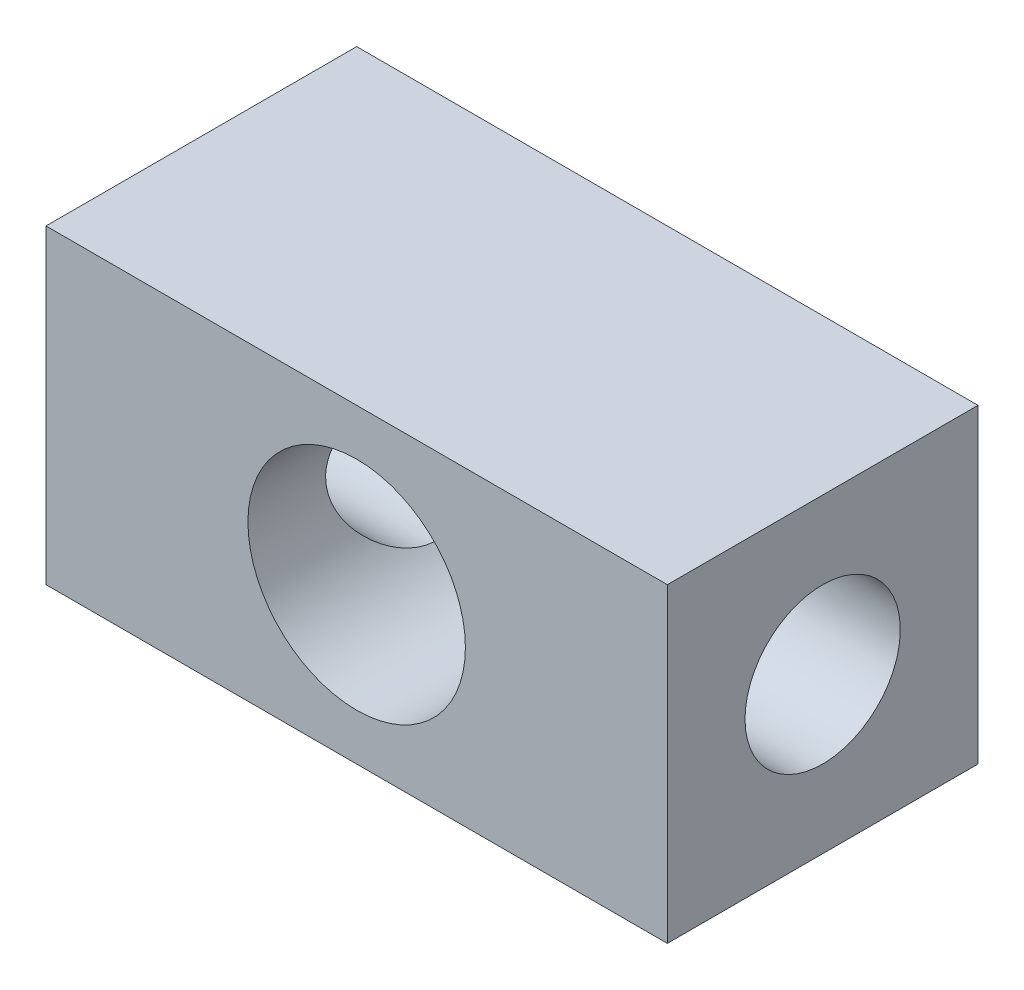
ISO-10303-21;
HEADER;
FILE_DESCRIPTION(('STEP AP214'),'2;1');
FILE_NAME('part.step','',(''),(''),'','','');
FILE_SCHEMA(('AUTOMOTIVE_DESIGN { 1 0 10303 214 1 1 1 1 }'));
ENDSEC;
DATA;
#1=APPLICATION_CONTEXT('core data for automotive mechanical design processes');
#2=APPLICATION_PROTOCOL_DEFINITION('international standard','automotive_design',2000,#1);
#3=PRODUCT_CONTEXT('',#1,'mechanical');
#4=PRODUCT('Part','Part','',(#3));
#5=PRODUCT_RELATED_PRODUCT_CATEGORY('part','',(#4));
#6=PRODUCT_DEFINITION_FORMATION('','',#4);
#7=PRODUCT_DEFINITION_CONTEXT('part definition',#1,'design');
#8=PRODUCT_DEFINITION('design','',#6,#7);
#9=PRODUCT_DEFINITION_SHAPE('','',#8);
#10=(LENGTH_UNIT() NAMED_UNIT(*) SI_UNIT(.MILLI.,.METRE.));
#11=(NAMED_UNIT(*) PLANE_ANGLE_UNIT() SI_UNIT($,.RADIAN.));
#12=(NAMED_UNIT(*) SI_UNIT($,.STERADIAN.) SOLID_ANGLE_UNIT());
#13=UNCERTAINTY_MEASURE_WITH_UNIT(LENGTH_MEASURE(1.E-05),#10,'distance_accuracy_value','');
#14=(GEOMETRIC_REPRESENTATION_CONTEXT(3) GLOBAL_UNCERTAINTY_ASSIGNED_CONTEXT((#13)) GLOBAL_UNIT_ASSIGNED_CONTEXT((#10,
#11,#12)) REPRESENTATION_CONTEXT('',''));
#15=CARTESIAN_POINT('',(0.,0.,0.));
#16=DIRECTION('',(0.,0.,1.));
#17=DIRECTION('',(1.,0.,0.));
#18=AXIS2_PLACEMENT_3D('',#15,#16,#17);
#19=CARTESIAN_POINT('',(0.,0.,19.9999999999998));
#20=DIRECTION('',(0.,0.,-0.999999999999984));
#21=DIRECTION('',(-0.999999999999992,0.,0.));
#22=AXIS2_PLACEMENT_3D('',#19,#20,#21);
#23=PLANE('',#22);
#24=DIRECTION('',(0.,0.999999999999992,0.));
#25=VECTOR('',#24,1.);
#26=CARTESIAN_POINT('',(19.9999999999995,-9.99999999999999,19.9999999999998));
#27=LINE('',#26,#25);
#28=CARTESIAN_POINT('',(19.9999999999995,-9.99999999999999,19.9999999999998));
#29=VERTEX_POINT('',#28);
#30=CARTESIAN_POINT('',(20.,9.99999999999951,19.9999999999998));
#31=VERTEX_POINT('',#30);
#32=EDGE_CURVE('E98',#29,#31,#27,.T.);
#33=ORIENTED_EDGE('',*,*,#32,.T.);
#34=DIRECTION('',(-0.999999999999992,0.,0.));
#35=VECTOR('',#34,1.);
#36=CARTESIAN_POINT('',(-20.,10.,19.9999999999998));
#37=LINE('',#36,#35);
#38=CARTESIAN_POINT('',(-20.,10.,19.9999999999998));
#39=VERTEX_POINT('',#38);
#40=EDGE_CURVE('E93',#31,#39,#37,.T.);
#41=ORIENTED_EDGE('',*,*,#40,.T.);
#42=DIRECTION('',(0.,-0.999999999999992,0.));
#43=VECTOR('',#42,1.);
#44=CARTESIAN_POINT('',(-20.0000000000005,-9.99999999999952,19.9999999999998));
#45=LINE('',#44,#43);
#46=CARTESIAN_POINT('',(-20.0000000000005,-9.99999999999952,19.9999999999998));
#47=VERTEX_POINT('',#46);
#48=EDGE_CURVE('E96',#39,#47,#45,.T.);
#49=ORIENTED_EDGE('',*,*,#48,.T.);
#50=DIRECTION('',(0.999999999999992,0.,0.));
#51=VECTOR('',#50,1.);
#52=CARTESIAN_POINT('',(-20.0000000000005,-9.99999999999952,19.9999999999998));
#53=LINE('',#52,#51);
#54=EDGE_CURVE('E63',#47,#29,#53,.T.);
#55=ORIENTED_EDGE('',*,*,#54,.T.);
#56=EDGE_LOOP('',(#33,#41,#49,#55));
#57=FACE_BOUND('',#56,.T.);
#58=CARTESIAN_POINT('',(0.,0.,19.9999999999998));
#59=DIRECTION('',(0.,0.,0.999999999999984));
#60=DIRECTION('',(0.999999999999992,0.,0.));
#61=AXIS2_PLACEMENT_3D('',#58,#59,#60);
#62=CIRCLE('',#61,7.);
#63=CARTESIAN_POINT('',(6.99999999999994,0.,19.9999999999998));
#64=VERTEX_POINT('',#63);
#65=EDGE_CURVE('E120',#64,#64,#62,.T.);
#66=ORIENTED_EDGE('',*,*,#65,.F.);
#67=EDGE_LOOP('',(#66));
#68=FACE_BOUND('',#67,.T.);
#69=ADVANCED_FACE('F38',(#57,#68),#23,.F.);
#70=CARTESIAN_POINT('',(0.,0.,0.));
#71=DIRECTION('',(0.,0.,-0.999999999999984));
#72=DIRECTION('',(-0.999999999999992,0.,0.));
#73=AXIS2_PLACEMENT_3D('',#70,#71,#72);
#74=PLANE('',#73);
#75=DIRECTION('',(0.,0.999999999999992,0.));
#76=VECTOR('',#75,1.);
#77=CARTESIAN_POINT('',(19.9999999999995,-9.99999999999999,0.));
#78=LINE('',#77,#76);
#79=CARTESIAN_POINT('',(19.9999999999995,-9.99999999999999,0.));
#80=VERTEX_POINT('',#79);
#81=CARTESIAN_POINT('',(20.,9.99999999999951,0.));
#82=VERTEX_POINT('',#81);
#83=EDGE_CURVE('E116',#80,#82,#78,.T.);
#84=ORIENTED_EDGE('',*,*,#83,.F.);
#85=DIRECTION('',(0.999999999999992,0.,0.));
#86=VECTOR('',#85,1.);
#87=CARTESIAN_POINT('',(-20.0000000000005,-9.99999999999952,0.));
#88=LINE('',#87,#86);
#89=CARTESIAN_POINT('',(-20.0000000000005,-9.99999999999952,0.));
#90=VERTEX_POINT('',#89);
#91=EDGE_CURVE('E86',#90,#80,#88,.T.);
#92=ORIENTED_EDGE('',*,*,#91,.F.);
#93=DIRECTION('',(0.,-0.999999999999992,0.));
#94=VECTOR('',#93,1.);
#95=CARTESIAN_POINT('',(-20.0000000000005,-9.99999999999952,0.));
#96=LINE('',#95,#94);
#97=CARTESIAN_POINT('',(-20.,10.,0.));
#98=VERTEX_POINT('',#97);
#99=EDGE_CURVE('E80',#98,#90,#96,.T.);
#100=ORIENTED_EDGE('',*,*,#99,.F.);
#101=DIRECTION('',(-0.999999999999992,0.,0.));
#102=VECTOR('',#101,1.);
#103=CARTESIAN_POINT('',(-20.,10.,0.));
#104=LINE('',#103,#102);
#105=EDGE_CURVE('E103',#82,#98,#104,.T.);
#106=ORIENTED_EDGE('',*,*,#105,.F.);
#107=EDGE_LOOP('',(#84,#92,#100,#106));
#108=FACE_BOUND('',#107,.T.);
#109=CARTESIAN_POINT('',(0.,0.,0.));
#110=DIRECTION('',(0.,0.,0.999999999999984));
#111=DIRECTION('',(0.999999999999992,0.,0.));
#112=AXIS2_PLACEMENT_3D('',#109,#110,#111);
#113=CIRCLE('',#112,7.);
#114=CARTESIAN_POINT('',(6.99999999999994,0.,0.));
#115=VERTEX_POINT('',#114);
#116=EDGE_CURVE('E180',#115,#115,#113,.T.);
#117=ORIENTED_EDGE('',*,*,#116,.T.);
#118=EDGE_LOOP('',(#117));
#119=FACE_BOUND('',#118,.T.);
#120=ADVANCED_FACE('F155',(#108,#119),#74,.T.);
#121=CARTESIAN_POINT('',(19.9999999999995,-9.99999999999999,19.9999999999998));
#122=DIRECTION('',(-0.999999999999992,0.,0.));
#123=DIRECTION('',(0.,0.,0.999999999999984));
#124=AXIS2_PLACEMENT_3D('',#121,#122,#123);
#125=PLANE('',#124);
#126=CARTESIAN_POINT('',(20.,-4.92661467177413E-13,9.99999999999988));
#127=DIRECTION('',(-0.999999999999992,0.,0.));
#128=DIRECTION('',(0.,0.,0.999999999999984));
#129=AXIS2_PLACEMENT_3D('',#126,#127,#128);
#130=CIRCLE('',#129,5.);
#131=CARTESIAN_POINT('',(20.,-4.92661467177413E-13,14.9999999999998));
#132=VERTEX_POINT('',#131);
#133=EDGE_CURVE('E136',#132,#132,#130,.T.);
#134=ORIENTED_EDGE('',*,*,#133,.T.);
#135=EDGE_LOOP('',(#134));
#136=FACE_BOUND('',#135,.T.);
#137=ORIENTED_EDGE('',*,*,#83,.T.);
#138=DIRECTION('',(0.,0.,-0.999999999999984));
#139=VECTOR('',#138,1.);
#140=CARTESIAN_POINT('',(20.,9.99999999999951,19.9999999999998));
#141=LINE('',#140,#139);
#142=EDGE_CURVE('E11',#31,#82,#141,.T.);
#143=ORIENTED_EDGE('',*,*,#142,.F.);
#144=ORIENTED_EDGE('',*,*,#32,.F.);
#145=DIRECTION('',(0.,0.,-0.999999999999984));
#146=VECTOR('',#145,1.);
#147=CARTESIAN_POINT('',(19.9999999999995,-9.99999999999999,19.9999999999998));
#148=LINE('',#147,#146);
#149=EDGE_CURVE('E112',#29,#80,#148,.T.);
#150=ORIENTED_EDGE('',*,*,#149,.T.);
#151=EDGE_LOOP('',(#137,#143,#144,#150));
#152=FACE_BOUND('',#151,.T.);
#153=ADVANCED_FACE('F40',(#136,#152),#125,.F.);
#154=CARTESIAN_POINT('',(-20.,10.,19.9999999999998));
#155=DIRECTION('',(0.,-0.999999999999992,0.));
#156=DIRECTION('',(0.,0.,-0.999999999999984));
#157=AXIS2_PLACEMENT_3D('',#154,#155,#156);
#158=PLANE('',#157);
#159=ORIENTED_EDGE('',*,*,#105,.T.);
#160=DIRECTION('',(0.,0.,-0.999999999999984));
#161=VECTOR('',#160,1.);
#162=CARTESIAN_POINT('',(-20.,10.,19.9999999999998));
#163=LINE('',#162,#161);
#164=EDGE_CURVE('E54',#39,#98,#163,.T.);
#165=ORIENTED_EDGE('',*,*,#164,.F.);
#166=ORIENTED_EDGE('',*,*,#40,.F.);
#167=ORIENTED_EDGE('',*,*,#142,.T.);
#168=EDGE_LOOP('',(#159,#165,#166,#167));
#169=FACE_BOUND('',#168,.T.);
#170=ADVANCED_FACE('F102',(#169),#158,.F.);
#171=CARTESIAN_POINT('',(-20.0000000000005,-9.99999999999952,19.9999999999998));
#172=DIRECTION('',(0.999999999999992,0.,0.));
#173=DIRECTION('',(0.,0.,-0.999999999999984));
#174=AXIS2_PLACEMENT_3D('',#171,#172,#173);
#175=PLANE('',#174);
#176=CARTESIAN_POINT('',(-20.,0.,9.99999999999988));
#177=DIRECTION('',(-0.999999999999992,0.,0.));
#178=DIRECTION('',(0.,0.,0.999999999999984));
#179=AXIS2_PLACEMENT_3D('',#176,#177,#178);
#180=CIRCLE('',#179,5.);
#181=CARTESIAN_POINT('',(-20.,0.,14.9999999999998));
#182=VERTEX_POINT('',#181);
#183=EDGE_CURVE('E199',#182,#182,#180,.T.);
#184=ORIENTED_EDGE('',*,*,#183,.F.);
#185=EDGE_LOOP('',(#184));
#186=FACE_BOUND('',#185,.T.);
#187=ORIENTED_EDGE('',*,*,#99,.T.);
#188=DIRECTION('',(0.,0.,-0.999999999999984));
#189=VECTOR('',#188,1.);
#190=CARTESIAN_POINT('',(-20.0000000000005,-9.99999999999952,19.9999999999998));
#191=LINE('',#190,#189);
#192=EDGE_CURVE('E105',#47,#90,#191,.T.);
#193=ORIENTED_EDGE('',*,*,#192,.F.);
#194=ORIENTED_EDGE('',*,*,#48,.F.);
#195=ORIENTED_EDGE('',*,*,#164,.T.);
#196=EDGE_LOOP('',(#187,#193,#194,#195));
#197=FACE_BOUND('',#196,.T.);
#198=ADVANCED_FACE('F107',(#186,#197),#175,.F.);
#199=CARTESIAN_POINT('',(-20.0000000000005,-9.99999999999952,19.9999999999998));
#200=DIRECTION('',(0.,0.999999999999992,0.));
#201=DIRECTION('',(0.,0.,0.999999999999984));
#202=AXIS2_PLACEMENT_3D('',#199,#200,#201);
#203=PLANE('',#202);
#204=ORIENTED_EDGE('',*,*,#91,.T.);
#205=ORIENTED_EDGE('',*,*,#149,.F.);
#206=ORIENTED_EDGE('',*,*,#54,.F.);
#207=ORIENTED_EDGE('',*,*,#192,.T.);
#208=EDGE_LOOP('',(#204,#205,#206,#207));
#209=FACE_BOUND('',#208,.T.);
#210=ADVANCED_FACE('F151',(#209),#203,.F.);
#211=CARTESIAN_POINT('',(0.,0.,19.9999999999998));
#212=DIRECTION('',(0.,0.,-0.999999999999984));
#213=DIRECTION('',(-0.999999999999992,0.,0.));
#214=AXIS2_PLACEMENT_3D('',#211,#212,#213);
#215=CYLINDRICAL_SURFACE('',#214,7.);
#216=CARTESIAN_POINT('',(-7.00000000000001,0.,14.9999999999997));
#217=CARTESIAN_POINT('',(-7.00000020838973,-0.123706830347805,15.0000002235467));
#218=CARTESIAN_POINT('',(-6.9967139987286,-0.247410973485887,14.9954026823639));
#219=CARTESIAN_POINT('',(-6.98364877001322,-0.493842597599144,14.9770866330283));
#220=CARTESIAN_POINT('',(-6.97386724806996,-0.616569683621388,14.9633646088648));
#221=CARTESIAN_POINT('',(-6.94804684346392,-0.8600169345434,14.9270192039855));
#222=CARTESIAN_POINT('',(-6.93200830974386,-0.980737210968106,14.9043963196546));
#223=CARTESIAN_POINT('',(-6.89403980063153,-1.2193522544136,14.8505822220874));
#224=CARTESIAN_POINT('',(-6.87210728454189,-1.33724577898899,14.8193873136092));
#225=CARTESIAN_POINT('',(-6.8229681756075,-1.56876671294683,14.7490551859887));
#226=CARTESIAN_POINT('',(-6.79579130680711,-1.68241404829331,14.7099626730663));
#227=CARTESIAN_POINT('',(-6.73663568699667,-1.90554075562307,14.6241993320913));
#228=CARTESIAN_POINT('',(-6.70465504948949,-2.01501846887817,14.5775255261861));
#229=CARTESIAN_POINT('',(-6.60241573373066,-2.3363458262759,14.426891765315));
#230=CARTESIAN_POINT('',(-6.52581508656124,-2.54129209226529,14.3122568985109));
#231=CARTESIAN_POINT('',(-6.35349136110252,-2.94722710575681,14.046966332333));
#232=CARTESIAN_POINT('',(-6.25666965742072,-3.14621427453574,13.8940028483968));
#233=CARTESIAN_POINT('',(-6.05567589289293,-3.51757946240297,13.5621257159282));
#234=CARTESIAN_POINT('',(-5.95149294556465,-3.68991681632723,13.3831732017844));
#235=CARTESIAN_POINT('',(-5.78580169781964,-3.94171508067847,13.0796743465278));
#236=CARTESIAN_POINT('',(-5.72420876579598,-4.03039974891799,12.9626846223724));
#237=CARTESIAN_POINT('',(-5.60277478998987,-4.19756740724413,12.7206732301415));
#238=CARTESIAN_POINT('',(-5.54293422728701,-4.27604761586084,12.595649385992));
#239=CARTESIAN_POINT('',(-5.42706064686451,-4.42218280560598,12.3379889887195));
#240=CARTESIAN_POINT('',(-5.37102235890195,-4.4898529542356,12.2053634631193));
#241=CARTESIAN_POINT('',(-5.26491676198806,-4.61381658166172,11.9326555040714));
#242=CARTESIAN_POINT('',(-5.21484853251542,-4.67011181528468,11.792574225054));
#243=CARTESIAN_POINT('',(-5.10685206277557,-4.7883819882448,11.453927188912));
#244=CARTESIAN_POINT('',(-5.05248282898125,-4.84522975768879,11.2523117138446));
#245=CARTESIAN_POINT('',(-4.98781463924016,-4.91148095084015,10.9426138259305));
#246=CARTESIAN_POINT('',(-4.96907802082134,-4.93038988462367,10.8382228939427));
#247=CARTESIAN_POINT('',(-4.93791198912532,-4.96160430011165,10.6275366581224));
#248=CARTESIAN_POINT('',(-4.92548008185897,-4.97391239305785,10.5212421245622));
#249=CARTESIAN_POINT('',(-4.90740411338569,-4.99174806834481,10.3067748634485));
#250=CARTESIAN_POINT('',(-4.90180679564454,-4.99722896284063,10.1985942785351));
#251=CARTESIAN_POINT('',(-4.89781588192487,-5.00114067376618,9.98197318784434));
#252=CARTESIAN_POINT('',(-4.89942206309582,-4.99957170829339,9.87353269021138));
#253=CARTESIAN_POINT('',(-4.90976470584961,-4.98941497357778,9.65727111060063));
#254=CARTESIAN_POINT('',(-4.91850485918716,-4.98082357029485,9.54945037844392));
#255=CARTESIAN_POINT('',(-4.94272114520704,-4.95679292982502,9.33530153044341));
#256=CARTESIAN_POINT('',(-4.95820063893986,-4.94135027570232,9.22897418673198));
#257=CARTESIAN_POINT('',(-4.99760451378599,-4.90151284488863,9.00517491853056));
#258=CARTESIAN_POINT('',(-5.02235272142069,-4.87622911468873,8.88800608955653));
#259=CARTESIAN_POINT('',(-5.07843189223425,-4.81779740683501,8.65723326425947));
#260=CARTESIAN_POINT('',(-5.10976728413051,-4.78464413635913,8.54363172566975));
#261=CARTESIAN_POINT('',(-5.21188277843332,-4.67400343048202,8.20862755517835));
#262=CARTESIAN_POINT('',(-5.29073017996704,-4.58537486342014,7.99324123016086));
#263=CARTESIAN_POINT('',(-5.43117977056445,-4.41699659938636,7.65204599043592));
#264=CARTESIAN_POINT('',(-5.48936415421434,-4.34470821312967,7.52094158802316));
#265=CARTESIAN_POINT('',(-5.60880434984635,-4.18937966154071,7.26663631329907));
#266=CARTESIAN_POINT('',(-5.67006102833891,-4.10633645234885,7.1434376933229));
#267=CARTESIAN_POINT('',(-5.79375242217182,-3.92989283704836,6.90517433077248));
#268=CARTESIAN_POINT('',(-5.85618806526465,-3.83648396587965,6.79011636365125));
#269=CARTESIAN_POINT('',(-5.98049354239976,-3.63967604580767,6.56857115451686));
#270=CARTESIAN_POINT('',(-6.04236343357915,-3.53627801821646,6.46208303834074));
#271=CARTESIAN_POINT('',(-6.16459711373886,-3.31865566402191,6.25712810012962));
#272=CARTESIAN_POINT('',(-6.22493938999137,-3.20433257194003,6.1587531181748));
#273=CARTESIAN_POINT('',(-6.34192222059391,-2.96607983417485,5.97193873301371));
#274=CARTESIAN_POINT('',(-6.39856329043482,-2.84215153154974,5.88349794496925));
#275=CARTESIAN_POINT('',(-6.50656183204893,-2.58534749281645,5.71755840499967));
#276=CARTESIAN_POINT('',(-6.5579287142744,-2.45248841807648,5.6400400693329));
#277=CARTESIAN_POINT('',(-6.65402794776653,-2.1782999787836,5.4967890060317));
#278=CARTESIAN_POINT('',(-6.69876279357062,-2.03697382721868,5.43105184513832));
#279=CARTESIAN_POINT('',(-6.76979900167759,-1.78393161589398,5.32761267432847));
#280=CARTESIAN_POINT('',(-6.79788920127105,-1.67388190691359,5.28703979494306));
#281=CARTESIAN_POINT('',(-6.84910120159545,-1.45016241863139,5.21346826836561));
#282=CARTESIAN_POINT('',(-6.87222406946423,-1.33649342290235,5.18046799423759));
#283=CARTESIAN_POINT('',(-6.91302945246583,-1.10620699746518,5.12245952686409));
#284=CARTESIAN_POINT('',(-6.93071352231445,-0.989590420676784,5.09744904960391));
#285=CARTESIAN_POINT('',(-6.96026202465164,-0.754198086697397,5.05576458904342));
#286=CARTESIAN_POINT('',(-6.9721290724302,-0.635423324765784,5.03908685933646));
#287=CARTESIAN_POINT('',(-6.9898180326742,-0.396096531940557,5.01425707098359));
#288=CARTESIAN_POINT('',(-6.99561783247229,-0.275539612785588,5.00613619784966));
#289=CARTESIAN_POINT('',(-7.00095849009119,-0.0340589156115996,4.99865751346771));
#290=CARTESIAN_POINT('',(-7.00050163923066,0.0868647118914972,4.99929649417484));
#291=CARTESIAN_POINT('',(-6.99334434902713,0.32819487387,5.0093209417246));
#292=CARTESIAN_POINT('',(-6.98664219024222,0.448601256767236,5.01870881729023));
#293=CARTESIAN_POINT('',(-6.96714954851426,0.687926838509074,5.04608590608886));
#294=CARTESIAN_POINT('',(-6.95435917772169,0.806846064707066,5.06407496088021));
#295=CARTESIAN_POINT('',(-6.92373169105252,1.03669034077475,5.10732357714417));
#296=CARTESIAN_POINT('',(-6.90616594722286,1.14772530670985,5.13219319610467));
#297=CARTESIAN_POINT('',(-6.86612520630985,1.36703042618002,5.1891703495779));
#298=CARTESIAN_POINT('',(-6.84364861236168,1.47529966756191,5.22128023852367));
#299=CARTESIAN_POINT('',(-6.76946421834352,1.79502091246225,5.32792482053032));
#300=CARTESIAN_POINT('',(-6.71097815818561,2.0015570607615,5.4128072090868));
#301=CARTESIAN_POINT('',(-6.57387491863988,2.4158013396306,5.61571771440943));
#302=CARTESIAN_POINT('',(-6.49391167742692,2.62191172181234,5.73605629620726));
#303=CARTESIAN_POINT('',(-6.32248637138395,3.01190946129224,6.00197911016946));
#304=CARTESIAN_POINT('',(-6.23101540686784,3.19577940035423,6.14758291502083));
#305=CARTESIAN_POINT('',(-6.02506352997625,3.57103500131529,6.48953581447124));
#306=CARTESIAN_POINT('',(-5.90941444692481,3.75775754044467,6.69029969005171));
#307=CARTESIAN_POINT('',(-5.67976360472236,4.09660125204293,7.12026996408595));
#308=CARTESIAN_POINT('',(-5.56576275441118,4.24870396900502,7.34949143286825));
#309=CARTESIAN_POINT('',(-5.36830225813517,4.4946887035956,7.797165849694));
#310=CARTESIAN_POINT('',(-5.28284827698364,4.59394222437912,8.01177234065841));
#311=CARTESIAN_POINT('',(-5.13141345636209,4.76250754552193,8.4588015461608));
#312=CARTESIAN_POINT('',(-5.06539151754954,4.83188268572662,8.69118532943065));
#313=CARTESIAN_POINT('',(-4.97281140949577,4.92694108133017,9.12536440967209));
#314=CARTESIAN_POINT('',(-4.94119323485699,4.95835553271124,9.32479519441026));
#315=CARTESIAN_POINT('',(-4.90241792810089,4.99670946606537,9.72827233820071));
#316=CARTESIAN_POINT('',(-4.89523352826003,5.00367623156318,9.93231329610971));
#317=CARTESIAN_POINT('',(-4.90648075072078,4.99264295050727,10.3389850866712));
#318=CARTESIAN_POINT('',(-4.92491410752098,4.97464121341411,10.5416158229084));
#319=CARTESIAN_POINT('',(-4.98443760918039,4.91498710965499,10.9400224787394));
#320=CARTESIAN_POINT('',(-5.02556280172854,4.87329815495575,11.135787295171));
#321=CARTESIAN_POINT('',(-5.14200261452265,4.75069025016368,11.5814422945041));
#322=CARTESIAN_POINT('',(-5.22418017553785,4.66126522644867,11.8271975118351));
#323=CARTESIAN_POINT('',(-5.36059508623788,4.50210411725602,12.1789259463673));
#324=CARTESIAN_POINT('',(-5.40832357564236,4.44479567507552,12.2934790660688));
#325=CARTESIAN_POINT('',(-5.50678597491563,4.32220971449357,12.5168864608464));
#326=CARTESIAN_POINT('',(-5.55751965778054,4.25693279761421,12.6257411651976));
#327=CARTESIAN_POINT('',(-5.71505652733009,4.04590690194077,12.9492592128555));
#328=CARTESIAN_POINT('',(-5.82467625637427,3.88776756391502,13.1547112586291));
#329=CARTESIAN_POINT('',(-5.98735914065872,3.62795510967357,13.443063811555));
#330=CARTESIAN_POINT('',(-6.04132015327551,3.53753675683184,13.5359153498656));
#331=CARTESIAN_POINT('',(-6.14770901514375,3.34923083939272,13.7147695884307));
#332=CARTESIAN_POINT('',(-6.20013658873392,3.25134194311756,13.8007710620019));
#333=CARTESIAN_POINT('',(-6.31122907951895,3.03086404240047,13.9796140827871));
#334=CARTESIAN_POINT('',(-6.36941716980577,2.90692152521491,14.0710904912996));
#335=CARTESIAN_POINT('',(-6.48069645050256,2.64956836988835,14.2430793444256));
#336=CARTESIAN_POINT('',(-6.53378994050184,2.51616205124382,14.3235967426258));
#337=CARTESIAN_POINT('',(-6.63333305417822,2.24060912964317,14.4726028891803));
#338=CARTESIAN_POINT('',(-6.6797893509917,2.09847151388443,14.5411037351812));
#339=CARTESIAN_POINT('',(-6.76463878724721,1.80631427486923,14.665016401042));
#340=CARTESIAN_POINT('',(-6.80303505370807,1.65629773671334,14.7204332980759));
#341=CARTESIAN_POINT('',(-6.86305258081174,1.3833108981588,14.8064765581733));
#342=CARTESIAN_POINT('',(-6.8865060472747,1.26160961479057,14.8398741605641));
#343=CARTESIAN_POINT('',(-6.92714135495755,1.01504263181041,14.8975204885344));
#344=CARTESIAN_POINT('',(-6.94432457497392,0.890177634349862,14.9217712255044));
#345=CARTESIAN_POINT('',(-6.97198481931338,0.638329109483783,14.9607217367808));
#346=CARTESIAN_POINT('',(-6.98246701467066,0.511347293416898,14.9754288758055));
#347=CARTESIAN_POINT('',(-6.99647449097442,0.256242689441575,14.995067883044));
#348=CARTESIAN_POINT('',(-6.99999978417627,0.128119903543484,14.9999997684781));
#349=CARTESIAN_POINT('',(-7.00000000000001,0.,14.9999999999997));
#350=B_SPLINE_CURVE_WITH_KNOTS('',3,(#216,#217,#218,#219,#220,#221,#222,#223,#224,#225,#226,
#227,#228,#229,#230,#231,#232,#233,#234,#235,#236,#237,#238,#239,#240,#241,#242,#243,#244,#245,
#246,#247,#248,#249,#250,#251,#252,#253,#254,#255,#256,#257,#258,#259,#260,#261,#262,#263,#264,
#265,#266,#267,#268,#269,#270,#271,#272,#273,#274,#275,#276,#277,#278,#279,#280,#281,#282,#283,
#284,#285,#286,#287,#288,#289,#290,#291,#292,#293,#294,#295,#296,#297,#298,#299,#300,#301,#302,
#303,#304,#305,#306,#307,#308,#309,#310,#311,#312,#313,#314,#315,#316,#317,#318,#319,#320,#321,
#322,#323,#324,#325,#326,#327,#328,#329,#330,#331,#332,#333,#334,#335,#336,#337,#338,#339,#340,
#341,#342,#343,#344,#345,#346,#347,#348,#349),.UNSPECIFIED.,.T.,.F.,(4,2,2,2,2,2,2,2,2,2,2,2,2,
2,2,2,2,2,2,2,2,2,2,2,2,2,2,2,2,2,2,2,2,2,2,2,2,2,2,2,2,2,2,2,2,2,2,2,2,2,2,2,2,2,2,2,2,2,2,2,2,
2,2,2,2,2,4),(0.,0.370988075311363,0.742119189353167,1.113229609013,1.48450025920449,
1.85372534219346,2.22309580520351,2.96119440683004,3.76545645669395,4.57093387736659,
5.04808282383822,5.52536155725348,6.00196462889938,6.47849411798956,7.12486898649131,
7.44773292534215,7.77046904731926,8.09540029733815,8.42032149521384,8.7454109430361,
9.07066270584188,9.43729317450044,9.80417093025943,10.5385885670463,11.0199765172874,
11.5015010102357,11.9834216722653,12.4652931137684,12.9520296640941,13.4386982783508,
13.924482888458,14.4100843121045,14.771547101344,15.1329321592685,15.4942138166995,
15.8553328952554,16.2177635696501,16.5800615177675,16.9424592422924,17.3048502913748,
17.6498662512394,17.9949945676162,18.6847309611879,19.4371210061719,20.1900965430248,
21.0793568967476,21.9690902023828,22.7207890020046,23.4708863194352,24.0812720855673,
24.6909764464864,25.3007220906016,25.9114121377253,26.7290171085952,27.1388076467794,
27.5485672699124,28.3895670350437,28.8104556334682,29.2314194343297,29.7247401951241,
30.2178372239683,30.7104349429707,31.2028411960805,31.5874461531241,31.9719664863838,
32.3561897343841,32.740412305531),.UNSPECIFIED.);
#351=CARTESIAN_POINT('',(-7.00000000000001,0.,14.9999999999997));
#352=VERTEX_POINT('',#351);
#353=EDGE_CURVE('E42',#352,#352,#350,.T.);
#354=ORIENTED_EDGE('',*,*,#353,.F.);
#355=EDGE_LOOP('',(#354));
#356=FACE_BOUND('',#355,.T.);
#357=CARTESIAN_POINT('',(7.00000000000001,0.,14.9999999999997));
#358=CARTESIAN_POINT('',(7.00000020838973,0.123706830347808,15.0000002235466));
#359=CARTESIAN_POINT('',(6.9967139987286,0.247410973485882,14.9954026823638));
#360=CARTESIAN_POINT('',(6.98364877001322,0.493842597599135,14.9770866330282));
#361=CARTESIAN_POINT('',(6.97386724806996,0.616569683621382,14.9633646088647));
#362=CARTESIAN_POINT('',(6.94804684346392,0.860016934543379,14.9270192039853));
#363=CARTESIAN_POINT('',(6.93200830974386,0.980737210968066,14.9043963196543));
#364=CARTESIAN_POINT('',(6.89403980063153,1.21935225441358,14.8505822220873));
#365=CARTESIAN_POINT('',(6.87210728454188,1.33724577898901,14.8193873136092));
#366=CARTESIAN_POINT('',(6.82296817560751,1.56876671294681,14.7490551859887));
#367=CARTESIAN_POINT('',(6.79579130680713,1.68241404829322,14.7099626730661));
#368=CARTESIAN_POINT('',(6.73663568699672,1.9055407556229,14.6241993320909));
#369=CARTESIAN_POINT('',(6.70465504948955,2.01501846887798,14.5775255261857));
#370=CARTESIAN_POINT('',(6.6024157337307,2.33634582627578,14.4268917653147));
#371=CARTESIAN_POINT('',(6.5258150865612,2.54129209226536,14.312256898511));
#372=CARTESIAN_POINT('',(6.35349136110257,2.94722710575674,14.0469663323329));
#373=CARTESIAN_POINT('',(6.25666965742097,3.1462142745353,13.8940028483962));
#374=CARTESIAN_POINT('',(6.05567589289308,3.51757946240266,13.5621257159277));
#375=CARTESIAN_POINT('',(5.95149294556451,3.68991681632742,13.3831732017846));
#376=CARTESIAN_POINT('',(5.78580169781974,3.94171508067835,13.0796743465277));
#377=CARTESIAN_POINT('',(5.72420876579633,4.03039974891751,12.962684622372));
#378=CARTESIAN_POINT('',(5.60277478999041,4.1975674072434,12.7206732301408));
#379=CARTESIAN_POINT('',(5.54293422728748,4.27604761586022,12.5956493859914));
#380=CARTESIAN_POINT('',(5.42706064686507,4.4221828056053,12.3379889887188));
#381=CARTESIAN_POINT('',(5.37102235890267,4.48985295423475,12.2053634631185));
#382=CARTESIAN_POINT('',(5.26491676198853,4.61381658166118,11.9326555040709));
#383=CARTESIAN_POINT('',(5.2148485325155,4.67011181528462,11.7925742250539));
#384=CARTESIAN_POINT('',(5.10685206277551,4.78838198824491,11.4539271889121));
#385=CARTESIAN_POINT('',(5.05248282898176,4.84522975768826,11.2523117138443));
#386=CARTESIAN_POINT('',(4.98781463924123,4.91148095083906,10.9426138259301));
#387=CARTESIAN_POINT('',(4.96907802082254,4.93038988462246,10.8382228939422));
#388=CARTESIAN_POINT('',(4.93791198912597,4.961604300111,10.6275366581221));
#389=CARTESIAN_POINT('',(4.92548008185895,4.97391239305788,10.5212421245621));
#390=CARTESIAN_POINT('',(4.90740411338572,4.99174806834479,10.3067748634486));
#391=CARTESIAN_POINT('',(4.9018067956453,4.99722896283989,10.1985942785352));
#392=CARTESIAN_POINT('',(4.89781588192612,5.00114067376495,9.9819731878444));
#393=CARTESIAN_POINT('',(4.89942206309684,4.9995717082924,9.87353269021145));
#394=CARTESIAN_POINT('',(4.9097647058506,4.98941497357681,9.65727111060077));
#395=CARTESIAN_POINT('',(4.91850485918836,4.98082357029366,9.54945037844413));
#396=CARTESIAN_POINT('',(4.94272114520779,4.95679292982428,9.33530153044353));
#397=CARTESIAN_POINT('',(4.95820063893994,4.94135027570225,9.22897418673193));
#398=CARTESIAN_POINT('',(4.99760451378589,4.90151284488872,9.00517491853062));
#399=CARTESIAN_POINT('',(5.02235272142125,4.87622911468815,8.88800608955692));
#400=CARTESIAN_POINT('',(5.07843189223532,4.81779740683389,8.65723326426014));
#401=CARTESIAN_POINT('',(5.10976728413144,4.78464413635813,8.54363172567037));
#402=CARTESIAN_POINT('',(5.21188277843372,4.67400343048158,8.20862755517867));
#403=CARTESIAN_POINT('',(5.29073017996695,4.58537486342028,7.9932412301607));
#404=CARTESIAN_POINT('',(5.4311797705645,4.41699659938629,7.65204599043605));
#405=CARTESIAN_POINT('',(5.4893641542147,4.34470821312921,7.5209415880237));
#406=CARTESIAN_POINT('',(5.60880434984688,4.18937966154001,7.26663631329986));
#407=CARTESIAN_POINT('',(5.67006102833932,4.10633645234829,7.14343769332352));
#408=CARTESIAN_POINT('',(5.79375242217216,3.92989283704784,6.90517433077306));
#409=CARTESIAN_POINT('',(5.85618806526504,3.83648396587902,6.79011636365193));
#410=CARTESIAN_POINT('',(5.9804935424,3.63967604580728,6.56857115451725));
#411=CARTESIAN_POINT('',(6.04236343357919,3.53627801821641,6.46208303834073));
#412=CARTESIAN_POINT('',(6.16459711373883,3.31865566402195,6.25712810012961));
#413=CARTESIAN_POINT('',(6.22493938999148,3.20433257193982,6.15875311817521));
#414=CARTESIAN_POINT('',(6.34192222059409,2.96607983417447,5.97193873301437));
#415=CARTESIAN_POINT('',(6.39856329043495,2.84215153154946,5.88349794496976));
#416=CARTESIAN_POINT('',(6.50656183204901,2.58534749281622,5.7175584050001));
#417=CARTESIAN_POINT('',(6.5579287142745,2.45248841807621,5.64004006933342));
#418=CARTESIAN_POINT('',(6.65402794776659,2.17829997878343,5.49678900603199));
#419=CARTESIAN_POINT('',(6.69876279357063,2.03697382721867,5.43105184513829));
#420=CARTESIAN_POINT('',(6.76979900167758,1.78393161589399,5.32761267432849));
#421=CARTESIAN_POINT('',(6.79788920127106,1.67388190691353,5.2870397949433));
#422=CARTESIAN_POINT('',(6.84910120159547,1.45016241863129,5.21346826836598));
#423=CARTESIAN_POINT('',(6.87222406946424,1.33649342290228,5.18046799423786));
#424=CARTESIAN_POINT('',(6.91302945246583,1.10620699746513,5.12245952686428));
#425=CARTESIAN_POINT('',(6.93071352231445,0.989590420676736,5.09744904960412));
#426=CARTESIAN_POINT('',(6.96026202465165,0.754198086697367,5.05576458904355));
#427=CARTESIAN_POINT('',(6.97212907243023,0.635423324765778,5.03908685933648));
#428=CARTESIAN_POINT('',(6.98981803267423,0.396096531940572,5.01425707098357));
#429=CARTESIAN_POINT('',(6.99561783247229,0.2755396127856,5.00613619784968));
#430=CARTESIAN_POINT('',(7.00095849009119,0.0340589156116085,4.99865751346775));
#431=CARTESIAN_POINT('',(7.00050163923066,-0.0868647118914877,4.99929649417485));
#432=CARTESIAN_POINT('',(6.99334434902713,-0.328194873869997,5.00932094172451));
#433=CARTESIAN_POINT('',(6.98664219024222,-0.448601256767239,5.01870881729009));
#434=CARTESIAN_POINT('',(6.96714954851426,-0.68792683850907,5.04608590608877));
#435=CARTESIAN_POINT('',(6.95435917772169,-0.806846064707048,5.06407496088023));
#436=CARTESIAN_POINT('',(6.92373169105251,-1.03669034077475,5.10732357714415));
#437=CARTESIAN_POINT('',(6.90616594722285,-1.1477253067099,5.13219319610451));
#438=CARTESIAN_POINT('',(6.86612520630983,-1.36703042618011,5.18917034957758));
#439=CARTESIAN_POINT('',(6.84364861236165,-1.47529966756201,5.22128023852334));
#440=CARTESIAN_POINT('',(6.76946421834351,-1.79502091246232,5.32792482053009));
#441=CARTESIAN_POINT('',(6.71097815818564,-2.00155706076145,5.41280720908685));
#442=CARTESIAN_POINT('',(6.57387491863985,-2.41580133963065,5.61571771440937));
#443=CARTESIAN_POINT('',(6.49391167742678,-2.62191172181263,5.73605629620676));
#444=CARTESIAN_POINT('',(6.32248637138385,-3.01190946129249,6.00197911016898));
#445=CARTESIAN_POINT('',(6.23101540686789,-3.19577940035418,6.14758291502082));
#446=CARTESIAN_POINT('',(6.02506352997619,-3.57103500131534,6.48953581447126));
#447=CARTESIAN_POINT('',(5.9094144469244,-3.75775754044524,6.69029969005111));
#448=CARTESIAN_POINT('',(5.67976360472208,-4.09660125204339,7.12026996408536));
#449=CARTESIAN_POINT('',(5.56576275441137,-4.24870396900484,7.34949143286829));
#450=CARTESIAN_POINT('',(5.368302258135,-4.49468870359575,7.79716584969398));
#451=CARTESIAN_POINT('',(5.28284827698284,-4.59394222437999,8.01177234065788));
#452=CARTESIAN_POINT('',(5.13141345636147,-4.76250754552263,8.45880154616025));
#453=CARTESIAN_POINT('',(5.06539151754975,-4.83188268572643,8.69118532943058));
#454=CARTESIAN_POINT('',(4.9728114094956,-4.92694108133032,9.12536440967216));
#455=CARTESIAN_POINT('',(4.94119323485597,-4.95835553271224,9.32479519441013));
#456=CARTESIAN_POINT('',(4.90241792809995,-4.99670946606631,9.72827233820047));
#457=CARTESIAN_POINT('',(4.89523352826001,-5.00367623156319,9.93231329610957));
#458=CARTESIAN_POINT('',(4.9064807507208,-4.99264295050725,10.3389850866714));
#459=CARTESIAN_POINT('',(4.92491410752009,-4.97464121341499,10.5416158229088));
#460=CARTESIAN_POINT('',(4.98443760917939,-4.91498710965599,10.9400224787397));
#461=CARTESIAN_POINT('',(5.02556280172832,-4.87329815495596,11.135787295171));
#462=CARTESIAN_POINT('',(5.14200261452294,-4.7506902501634,11.581442294504));
#463=CARTESIAN_POINT('',(5.22418017553743,-4.66126522644915,11.8271975118355));
#464=CARTESIAN_POINT('',(5.36059508623715,-4.50210411725689,12.1789259463679));
#465=CARTESIAN_POINT('',(5.40832357564165,-4.44479567507639,12.2934790660695));
#466=CARTESIAN_POINT('',(5.50678597491522,-4.32220971449409,12.5168864608468));
#467=CARTESIAN_POINT('',(5.55751965778041,-4.25693279761436,12.6257411651977));
#468=CARTESIAN_POINT('',(5.71505652733032,-4.04590690194047,12.9492592128553));
#469=CARTESIAN_POINT('',(5.82467625637408,-3.8877675639153,13.1547112586295));
#470=CARTESIAN_POINT('',(5.98735914065837,-3.62795510967413,13.4430638115557));
#471=CARTESIAN_POINT('',(6.0413201532752,-3.53753675683239,13.5359153498663));
#472=CARTESIAN_POINT('',(6.14770901514359,-3.34923083939302,13.714769588431));
#473=CARTESIAN_POINT('',(6.20013658873388,-3.2513419431176,13.800771062002));
#474=CARTESIAN_POINT('',(6.31122907951898,-3.03086404240041,13.9796140827871));
#475=CARTESIAN_POINT('',(6.3694171698057,-2.90692152521508,14.0710904912999));
#476=CARTESIAN_POINT('',(6.48069645050242,-2.64956836988866,14.2430793444262));
#477=CARTESIAN_POINT('',(6.53378994050175,-2.51616205124405,14.3235967426263));
#478=CARTESIAN_POINT('',(6.63333305417817,-2.24060912964334,14.4726028891807));
#479=CARTESIAN_POINT('',(6.67978935099164,-2.09847151388463,14.5411037351816));
#480=CARTESIAN_POINT('',(6.76463878724718,-1.80631427486936,14.6650164010423));
#481=CARTESIAN_POINT('',(6.80303505370807,-1.65629773671336,14.7204332980759));
#482=CARTESIAN_POINT('',(6.86305258081174,-1.38331089815878,14.8064765581733));
#483=CARTESIAN_POINT('',(6.8865060472747,-1.26160961479059,14.8398741605643));
#484=CARTESIAN_POINT('',(6.92714135495754,-1.01504263181045,14.8975204885347));
#485=CARTESIAN_POINT('',(6.94432457497392,-0.890177634349887,14.9217712255046));
#486=CARTESIAN_POINT('',(6.97198481931338,-0.638329109483788,14.9607217367809));
#487=CARTESIAN_POINT('',(6.98246701467066,-0.511347293416901,14.9754288758056));
#488=CARTESIAN_POINT('',(6.99647449097442,-0.256242689441572,14.9950678830441));
#489=CARTESIAN_POINT('',(6.99999978417627,-0.128119903543478,14.9999997684781));
#490=CARTESIAN_POINT('',(7.00000000000001,0.,14.9999999999997));
#491=B_SPLINE_CURVE_WITH_KNOTS('',3,(#357,#358,#359,#360,#361,#362,#363,#364,#365,#366,#367,
#368,#369,#370,#371,#372,#373,#374,#375,#376,#377,#378,#379,#380,#381,#382,#383,#384,#385,#386,
#387,#388,#389,#390,#391,#392,#393,#394,#395,#396,#397,#398,#399,#400,#401,#402,#403,#404,#405,
#406,#407,#408,#409,#410,#411,#412,#413,#414,#415,#416,#417,#418,#419,#420,#421,#422,#423,#424,
#425,#426,#427,#428,#429,#430,#431,#432,#433,#434,#435,#436,#437,#438,#439,#440,#441,#442,#443,
#444,#445,#446,#447,#448,#449,#450,#451,#452,#453,#454,#455,#456,#457,#458,#459,#460,#461,#462,
#463,#464,#465,#466,#467,#468,#469,#470,#471,#472,#473,#474,#475,#476,#477,#478,#479,#480,#481,
#482,#483,#484,#485,#486,#487,#488,#489,#490),.UNSPECIFIED.,.T.,.F.,(4,2,2,2,2,2,2,2,2,2,2,2,2,
2,2,2,2,2,2,2,2,2,2,2,2,2,2,2,2,2,2,2,2,2,2,2,2,2,2,2,2,2,2,2,2,2,2,2,2,2,2,2,2,2,2,2,2,2,2,2,2,
2,2,2,2,2,4),(0.,0.370988075311349,0.742119189353156,1.11322960901299,1.48450025920445,
1.85372534219339,2.22309580520345,2.96119440682995,3.76545645669381,4.57093387736641,
5.04808282383789,5.52536155725318,6.00196462889909,6.47849411798912,7.12486898649077,
7.44773292534162,7.77046904731854,8.09540029733722,8.42032149521292,8.74541094303513,
9.07066270584078,9.43729317449913,9.80417093025816,10.538588567045,11.0199765172859,
11.5015010102342,11.9834216722638,12.4652931137668,12.9520296640924,13.4386982783492,
13.9244828884564,14.4100843121028,14.7715471013423,15.1329321592667,15.4942138166978,
15.8553328952536,16.2177635696484,16.5800615177658,16.9424592422907,17.3048502913731,
17.6498662512377,17.9949945676145,18.6847309611862,19.4371210061702,20.1900965430232,
21.0793568967461,21.9690902023813,22.7207890020031,23.4708863194339,24.0812720855661,
24.6909764464853,25.3007220906007,25.9114121377244,26.7290171085945,27.1388076467786,
27.5485672699118,28.3895670350431,28.8104556334676,29.2314194343291,29.7247401951236,
30.2178372239678,30.7104349429703,31.2028411960801,31.5874461531237,31.9719664863834,
32.3561897343837,32.7404123055306),.UNSPECIFIED.);
#492=CARTESIAN_POINT('',(7.00000000000001,0.,14.9999999999997));
#493=VERTEX_POINT('',#492);
#494=EDGE_CURVE('E130',#493,#493,#491,.T.);
#495=ORIENTED_EDGE('',*,*,#494,.F.);
#496=EDGE_LOOP('',(#495));
#497=FACE_BOUND('',#496,.T.);
#498=ORIENTED_EDGE('',*,*,#65,.T.);
#499=EDGE_LOOP('',(#498));
#500=FACE_BOUND('',#499,.T.);
#501=ORIENTED_EDGE('',*,*,#116,.F.);
#502=EDGE_LOOP('',(#501));
#503=FACE_BOUND('',#502,.T.);
#504=ADVANCED_FACE('F137',(#356,#497,#500,#503),#215,.F.);
#505=CARTESIAN_POINT('',(20.,-4.92661467177413E-13,9.99999999999988));
#506=DIRECTION('',(-0.999999999999992,0.,0.));
#507=DIRECTION('',(0.,0.,0.999999999999984));
#508=AXIS2_PLACEMENT_3D('',#505,#506,#507);
#509=CYLINDRICAL_SURFACE('',#508,5.);
#510=ORIENTED_EDGE('',*,*,#494,.T.);
#511=EDGE_LOOP('',(#510));
#512=FACE_BOUND('',#511,.T.);
#513=ORIENTED_EDGE('',*,*,#133,.F.);
#514=EDGE_LOOP('',(#513));
#515=FACE_BOUND('',#514,.T.);
#516=ADVANCED_FACE('F140',(#512,#515),#509,.F.);
#517=ORIENTED_EDGE('',*,*,#353,.T.);
#518=EDGE_LOOP('',(#517));
#519=FACE_BOUND('',#518,.T.);
#520=ORIENTED_EDGE('',*,*,#183,.T.);
#521=EDGE_LOOP('',(#520));
#522=FACE_BOUND('',#521,.T.);
#523=ADVANCED_FACE('F143',(#519,#522),#509,.F.);
#524=CLOSED_SHELL('',(#69,#120,#153,#170,#198,#210,#504,#516,#523));
#525=MANIFOLD_SOLID_BREP('B2',#524);
#526=ADVANCED_BREP_SHAPE_REPRESENTATION('',(#18,#525),#14);
#527=SHAPE_DEFINITION_REPRESENTATION(#9,#526);
ENDSEC;
END-ISO-10303-21;
